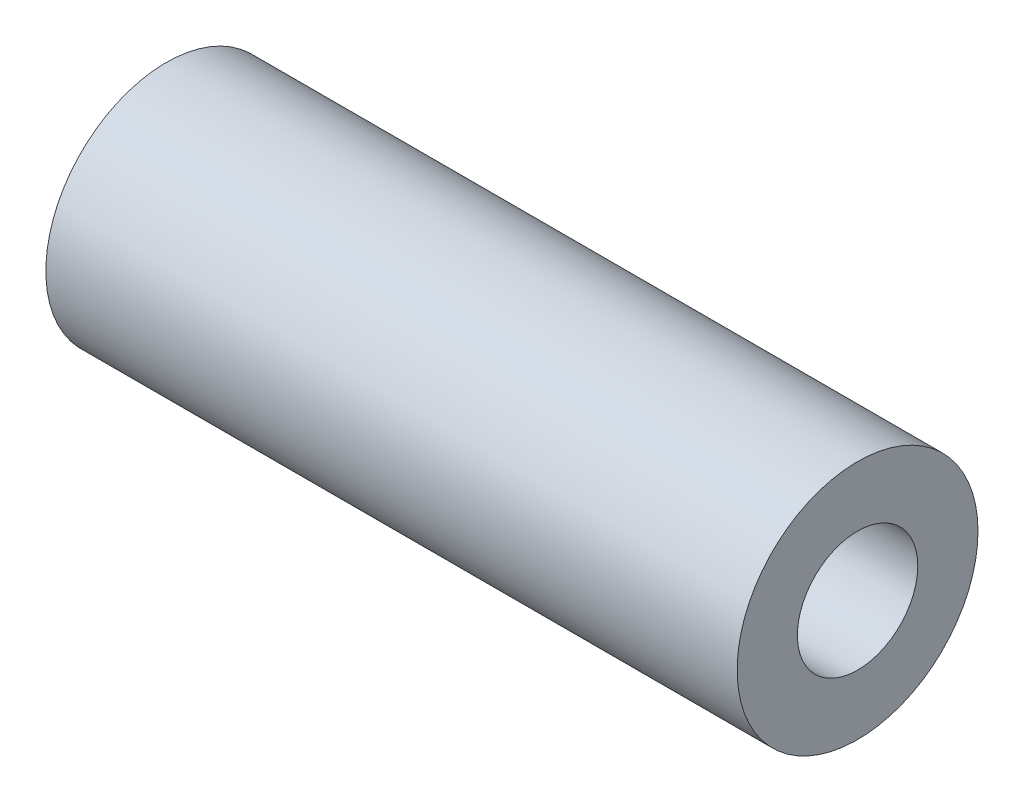
ISO-10303-21;
HEADER;
FILE_DESCRIPTION(('STEP AP214'),'2;1');
FILE_NAME('part.step','',(''),(''),'','','');
FILE_SCHEMA(('AUTOMOTIVE_DESIGN { 1 0 10303 214 1 1 1 1 }'));
ENDSEC;
DATA;
#1=APPLICATION_CONTEXT('core data for automotive mechanical design processes');
#2=APPLICATION_PROTOCOL_DEFINITION('international standard','automotive_design',2000,#1);
#3=PRODUCT_CONTEXT('',#1,'mechanical');
#4=PRODUCT('Part','Part','',(#3));
#5=PRODUCT_RELATED_PRODUCT_CATEGORY('part','',(#4));
#6=PRODUCT_DEFINITION_FORMATION('','',#4);
#7=PRODUCT_DEFINITION_CONTEXT('part definition',#1,'design');
#8=PRODUCT_DEFINITION('design','',#6,#7);
#9=PRODUCT_DEFINITION_SHAPE('','',#8);
#10=(LENGTH_UNIT() NAMED_UNIT(*) SI_UNIT(.MILLI.,.METRE.));
#11=(NAMED_UNIT(*) PLANE_ANGLE_UNIT() SI_UNIT($,.RADIAN.));
#12=(NAMED_UNIT(*) SI_UNIT($,.STERADIAN.) SOLID_ANGLE_UNIT());
#13=UNCERTAINTY_MEASURE_WITH_UNIT(LENGTH_MEASURE(1.E-05),#10,'distance_accuracy_value','');
#14=(GEOMETRIC_REPRESENTATION_CONTEXT(3) GLOBAL_UNCERTAINTY_ASSIGNED_CONTEXT((#13)) GLOBAL_UNIT_ASSIGNED_CONTEXT((#10,
#11,#12)) REPRESENTATION_CONTEXT('',''));
#15=CARTESIAN_POINT('',(0.,0.,0.));
#16=DIRECTION('',(0.,0.,1.));
#17=DIRECTION('',(1.,0.,0.));
#18=AXIS2_PLACEMENT_3D('',#15,#16,#17);
#19=CARTESIAN_POINT('',(36.449,0.,0.));
#20=DIRECTION('',(1.,0.,0.));
#21=DIRECTION('',(0.,0.,-1.));
#22=AXIS2_PLACEMENT_3D('',#19,#20,#21);
#23=PLANE('',#22);
#24=CARTESIAN_POINT('',(36.449,0.,0.));
#25=DIRECTION('',(1.,0.,0.));
#26=DIRECTION('',(0.,0.,-1.));
#27=AXIS2_PLACEMENT_3D('',#24,#25,#26);
#28=CIRCLE('',#27,6.35);
#29=CARTESIAN_POINT('',(36.449,0.,-6.35));
#30=VERTEX_POINT('',#29);
#31=EDGE_CURVE('E10',#30,#30,#28,.T.);
#32=ORIENTED_EDGE('',*,*,#31,.T.);
#33=EDGE_LOOP('',(#32));
#34=FACE_BOUND('',#33,.T.);
#35=CARTESIAN_POINT('',(36.449,0.,0.));
#36=DIRECTION('',(1.,0.,0.));
#37=DIRECTION('',(0.,0.,-1.));
#38=AXIS2_PLACEMENT_3D('',#35,#36,#37);
#39=CIRCLE('',#38,3.175);
#40=CARTESIAN_POINT('',(36.449,0.,-3.175));
#41=VERTEX_POINT('',#40);
#42=EDGE_CURVE('E41',#41,#41,#39,.T.);
#43=ORIENTED_EDGE('',*,*,#42,.F.);
#44=EDGE_LOOP('',(#43));
#45=FACE_BOUND('',#44,.T.);
#46=ADVANCED_FACE('F30',(#34,#45),#23,.T.);
#47=CARTESIAN_POINT('',(0.,0.,0.));
#48=DIRECTION('',(1.,0.,0.));
#49=DIRECTION('',(0.,0.,-1.));
#50=AXIS2_PLACEMENT_3D('',#47,#48,#49);
#51=PLANE('',#50);
#52=CARTESIAN_POINT('',(0.,0.,0.));
#53=DIRECTION('',(1.,0.,0.));
#54=DIRECTION('',(0.,0.,-1.));
#55=AXIS2_PLACEMENT_3D('',#52,#53,#54);
#56=CIRCLE('',#55,6.35);
#57=CARTESIAN_POINT('',(0.,0.,-6.35));
#58=VERTEX_POINT('',#57);
#59=EDGE_CURVE('E34',#58,#58,#56,.T.);
#60=ORIENTED_EDGE('',*,*,#59,.F.);
#61=EDGE_LOOP('',(#60));
#62=FACE_BOUND('',#61,.T.);
#63=CARTESIAN_POINT('',(0.,0.,0.));
#64=DIRECTION('',(1.,0.,0.));
#65=DIRECTION('',(0.,0.,-1.));
#66=AXIS2_PLACEMENT_3D('',#63,#64,#65);
#67=CIRCLE('',#66,3.175);
#68=CARTESIAN_POINT('',(0.,0.,-3.175));
#69=VERTEX_POINT('',#68);
#70=EDGE_CURVE('E43',#69,#69,#67,.T.);
#71=ORIENTED_EDGE('',*,*,#70,.T.);
#72=EDGE_LOOP('',(#71));
#73=FACE_BOUND('',#72,.T.);
#74=ADVANCED_FACE('F53',(#62,#73),#51,.F.);
#75=CARTESIAN_POINT('',(36.449,0.,0.));
#76=DIRECTION('',(-1.,0.,0.));
#77=DIRECTION('',(0.,0.,1.));
#78=AXIS2_PLACEMENT_3D('',#75,#76,#77);
#79=CYLINDRICAL_SURFACE('',#78,6.35);
#80=ORIENTED_EDGE('',*,*,#31,.F.);
#81=EDGE_LOOP('',(#80));
#82=FACE_BOUND('',#81,.T.);
#83=ORIENTED_EDGE('',*,*,#59,.T.);
#84=EDGE_LOOP('',(#83));
#85=FACE_BOUND('',#84,.T.);
#86=ADVANCED_FACE('F32',(#82,#85),#79,.T.);
#87=CARTESIAN_POINT('',(36.449,0.,0.));
#88=DIRECTION('',(-1.,0.,0.));
#89=DIRECTION('',(0.,0.,1.));
#90=AXIS2_PLACEMENT_3D('',#87,#88,#89);
#91=CYLINDRICAL_SURFACE('',#90,3.175);
#92=ORIENTED_EDGE('',*,*,#42,.T.);
#93=EDGE_LOOP('',(#92));
#94=FACE_BOUND('',#93,.T.);
#95=ORIENTED_EDGE('',*,*,#70,.F.);
#96=EDGE_LOOP('',(#95));
#97=FACE_BOUND('',#96,.T.);
#98=ADVANCED_FACE('F49',(#94,#97),#91,.F.);
#99=CLOSED_SHELL('',(#46,#74,#86,#98));
#100=MANIFOLD_SOLID_BREP('B2',#99);
#101=ADVANCED_BREP_SHAPE_REPRESENTATION('',(#18,#100),#14);
#102=SHAPE_DEFINITION_REPRESENTATION(#9,#101);
ENDSEC;
END-ISO-10303-21;
